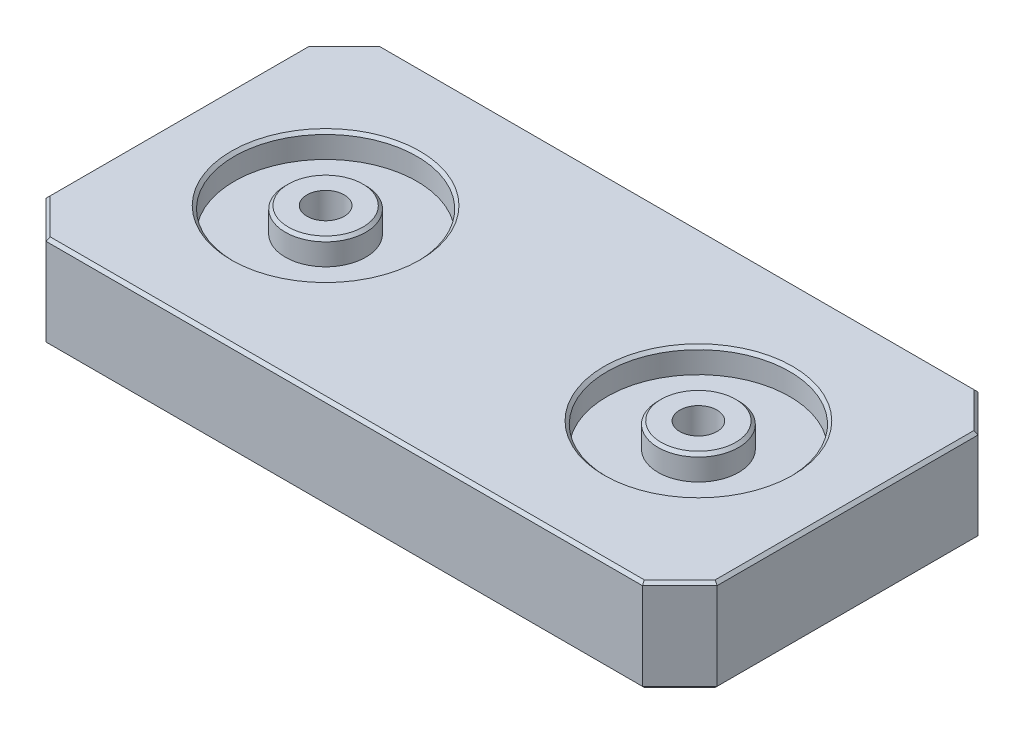
ISO-10303-21;
HEADER;
FILE_DESCRIPTION(('STEP AP214'),'2;1');
FILE_NAME('part.step','',(''),(''),'','','');
FILE_SCHEMA(('AUTOMOTIVE_DESIGN { 1 0 10303 214 1 1 1 1 }'));
ENDSEC;
DATA;
#1=APPLICATION_CONTEXT('core data for automotive mechanical design processes');
#2=APPLICATION_PROTOCOL_DEFINITION('international standard','automotive_design',2000,#1);
#3=PRODUCT_CONTEXT('',#1,'mechanical');
#4=PRODUCT('Part','Part','',(#3));
#5=PRODUCT_RELATED_PRODUCT_CATEGORY('part','',(#4));
#6=PRODUCT_DEFINITION_FORMATION('','',#4);
#7=PRODUCT_DEFINITION_CONTEXT('part definition',#1,'design');
#8=PRODUCT_DEFINITION('design','',#6,#7);
#9=PRODUCT_DEFINITION_SHAPE('','',#8);
#10=(LENGTH_UNIT() NAMED_UNIT(*) SI_UNIT(.MILLI.,.METRE.));
#11=(NAMED_UNIT(*) PLANE_ANGLE_UNIT() SI_UNIT($,.RADIAN.));
#12=(NAMED_UNIT(*) SI_UNIT($,.STERADIAN.) SOLID_ANGLE_UNIT());
#13=UNCERTAINTY_MEASURE_WITH_UNIT(LENGTH_MEASURE(1.E-05),#10,'distance_accuracy_value','');
#14=(GEOMETRIC_REPRESENTATION_CONTEXT(3) GLOBAL_UNCERTAINTY_ASSIGNED_CONTEXT((#13)) GLOBAL_UNIT_ASSIGNED_CONTEXT((#10,
#11,#12)) REPRESENTATION_CONTEXT('',''));
#15=CARTESIAN_POINT('',(0.,0.,0.));
#16=DIRECTION('',(0.,0.,1.));
#17=DIRECTION('',(1.,0.,0.));
#18=AXIS2_PLACEMENT_3D('',#15,#16,#17);
#19=CARTESIAN_POINT('',(31.75,11.684,0.));
#20=DIRECTION('',(0.,1.,0.));
#21=DIRECTION('',(0.,0.,1.));
#22=AXIS2_PLACEMENT_3D('',#19,#20,#21);
#23=PLANE('',#22);
#24=CARTESIAN_POINT('',(31.75,11.684,0.));
#25=DIRECTION('',(0.,1.,0.));
#26=DIRECTION('',(0.,0.,1.));
#27=AXIS2_PLACEMENT_3D('',#24,#25,#26);
#28=CIRCLE('',#27,15.5575);
#29=CARTESIAN_POINT('',(31.75,11.684,15.5575));
#30=VERTEX_POINT('',#29);
#31=EDGE_CURVE('E386',#30,#30,#28,.T.);
#32=ORIENTED_EDGE('',*,*,#31,.T.);
#33=EDGE_LOOP('',(#32));
#34=FACE_BOUND('',#33,.T.);
#35=CARTESIAN_POINT('',(31.75,11.684,0.));
#36=DIRECTION('',(0.,1.,0.));
#37=DIRECTION('',(0.,0.,1.));
#38=AXIS2_PLACEMENT_3D('',#35,#36,#37);
#39=CIRCLE('',#38,6.858);
#40=CARTESIAN_POINT('',(31.75,11.684,6.858));
#41=VERTEX_POINT('',#40);
#42=EDGE_CURVE('E296',#41,#41,#39,.T.);
#43=ORIENTED_EDGE('',*,*,#42,.F.);
#44=EDGE_LOOP('',(#43));
#45=FACE_BOUND('',#44,.T.);
#46=ADVANCED_FACE('F67',(#34,#45),#23,.T.);
#47=CARTESIAN_POINT('',(-31.75,11.684,0.));
#48=DIRECTION('',(0.,1.,0.));
#49=DIRECTION('',(0.,0.,1.));
#50=AXIS2_PLACEMENT_3D('',#47,#48,#49);
#51=PLANE('',#50);
#52=CARTESIAN_POINT('',(-31.75,11.684,0.));
#53=DIRECTION('',(0.,1.,0.));
#54=DIRECTION('',(0.,0.,1.));
#55=AXIS2_PLACEMENT_3D('',#52,#53,#54);
#56=CIRCLE('',#55,15.5575);
#57=CARTESIAN_POINT('',(-31.75,11.684,15.5575));
#58=VERTEX_POINT('',#57);
#59=EDGE_CURVE('E381',#58,#58,#56,.T.);
#60=ORIENTED_EDGE('',*,*,#59,.T.);
#61=EDGE_LOOP('',(#60));
#62=FACE_BOUND('',#61,.T.);
#63=CARTESIAN_POINT('',(-31.75,11.684,0.));
#64=DIRECTION('',(0.,1.,0.));
#65=DIRECTION('',(0.,0.,1.));
#66=AXIS2_PLACEMENT_3D('',#63,#64,#65);
#67=CIRCLE('',#66,6.858);
#68=CARTESIAN_POINT('',(-31.75,11.684,6.858));
#69=VERTEX_POINT('',#68);
#70=EDGE_CURVE('E389',#69,#69,#67,.T.);
#71=ORIENTED_EDGE('',*,*,#70,.F.);
#72=EDGE_LOOP('',(#71));
#73=FACE_BOUND('',#72,.T.);
#74=ADVANCED_FACE('F455',(#62,#73),#51,.T.);
#75=CARTESIAN_POINT('',(-57.15,15.875,-28.575));
#76=DIRECTION('',(1.,0.,0.));
#77=DIRECTION('',(0.,0.,-1.));
#78=AXIS2_PLACEMENT_3D('',#75,#76,#77);
#79=PLANE('',#78);
#80=DIRECTION('',(0.,1.,0.));
#81=VECTOR('',#80,1.);
#82=CARTESIAN_POINT('',(-57.15,0.,-22.225));
#83=LINE('',#82,#81);
#84=CARTESIAN_POINT('',(-57.15,0.507999999999995,-22.225));
#85=VERTEX_POINT('',#84);
#86=CARTESIAN_POINT('',(-57.15,15.367,-22.225));
#87=VERTEX_POINT('',#86);
#88=EDGE_CURVE('E335',#85,#87,#83,.T.);
#89=ORIENTED_EDGE('',*,*,#88,.F.);
#90=DIRECTION('',(0.,0.,1.));
#91=VECTOR('',#90,1.);
#92=CARTESIAN_POINT('',(-57.15,0.507999999999995,-28.575));
#93=LINE('',#92,#91);
#94=CARTESIAN_POINT('',(-57.15,0.507999999999995,22.225));
#95=VERTEX_POINT('',#94);
#96=EDGE_CURVE('E218',#85,#95,#93,.T.);
#97=ORIENTED_EDGE('',*,*,#96,.T.);
#98=DIRECTION('',(0.,1.,0.));
#99=VECTOR('',#98,1.);
#100=CARTESIAN_POINT('',(-57.15,0.,22.225));
#101=LINE('',#100,#99);
#102=CARTESIAN_POINT('',(-57.15,15.367,22.225));
#103=VERTEX_POINT('',#102);
#104=EDGE_CURVE('E337',#95,#103,#101,.T.);
#105=ORIENTED_EDGE('',*,*,#104,.T.);
#106=DIRECTION('',(0.,0.,-1.));
#107=VECTOR('',#106,1.);
#108=CARTESIAN_POINT('',(-57.15,15.367,-22.225));
#109=LINE('',#108,#107);
#110=EDGE_CURVE('E216',#103,#87,#109,.T.);
#111=ORIENTED_EDGE('',*,*,#110,.T.);
#112=EDGE_LOOP('',(#89,#97,#105,#111));
#113=FACE_BOUND('',#112,.T.);
#114=ADVANCED_FACE('F334',(#113),#79,.F.);
#115=CARTESIAN_POINT('',(-57.15,15.875,28.575));
#116=DIRECTION('',(0.,0.,-1.));
#117=DIRECTION('',(-1.,0.,0.));
#118=AXIS2_PLACEMENT_3D('',#115,#116,#117);
#119=PLANE('',#118);
#120=DIRECTION('',(0.,1.,0.));
#121=VECTOR('',#120,1.);
#122=CARTESIAN_POINT('',(-50.8,0.,28.575));
#123=LINE('',#122,#121);
#124=CARTESIAN_POINT('',(-50.8,0.507999999999995,28.575));
#125=VERTEX_POINT('',#124);
#126=CARTESIAN_POINT('',(-50.8,15.367,28.575));
#127=VERTEX_POINT('',#126);
#128=EDGE_CURVE('E344',#125,#127,#123,.T.);
#129=ORIENTED_EDGE('',*,*,#128,.F.);
#130=DIRECTION('',(1.,0.,0.));
#131=VECTOR('',#130,1.);
#132=CARTESIAN_POINT('',(-57.15,0.507999999999995,28.575));
#133=LINE('',#132,#131);
#134=CARTESIAN_POINT('',(50.8,0.507999999999995,28.575));
#135=VERTEX_POINT('',#134);
#136=EDGE_CURVE('E226',#125,#135,#133,.T.);
#137=ORIENTED_EDGE('',*,*,#136,.T.);
#138=DIRECTION('',(0.,1.,0.));
#139=VECTOR('',#138,1.);
#140=CARTESIAN_POINT('',(50.8,0.,28.575));
#141=LINE('',#140,#139);
#142=CARTESIAN_POINT('',(50.8,15.367,28.575));
#143=VERTEX_POINT('',#142);
#144=EDGE_CURVE('E370',#135,#143,#141,.T.);
#145=ORIENTED_EDGE('',*,*,#144,.T.);
#146=DIRECTION('',(-1.,0.,0.));
#147=VECTOR('',#146,1.);
#148=CARTESIAN_POINT('',(-50.8,15.367,28.575));
#149=LINE('',#148,#147);
#150=EDGE_CURVE('E224',#143,#127,#149,.T.);
#151=ORIENTED_EDGE('',*,*,#150,.T.);
#152=EDGE_LOOP('',(#129,#137,#145,#151));
#153=FACE_BOUND('',#152,.T.);
#154=ADVANCED_FACE('F499',(#153),#119,.F.);
#155=CARTESIAN_POINT('',(57.15,15.875,-28.575));
#156=DIRECTION('',(-1.,0.,0.));
#157=DIRECTION('',(0.,0.,1.));
#158=AXIS2_PLACEMENT_3D('',#155,#156,#157);
#159=PLANE('',#158);
#160=DIRECTION('',(0.,1.,0.));
#161=VECTOR('',#160,1.);
#162=CARTESIAN_POINT('',(57.15,0.,22.225));
#163=LINE('',#162,#161);
#164=CARTESIAN_POINT('',(57.15,0.507999999999995,22.225));
#165=VERTEX_POINT('',#164);
#166=CARTESIAN_POINT('',(57.15,15.367,22.225));
#167=VERTEX_POINT('',#166);
#168=EDGE_CURVE('E372',#165,#167,#163,.T.);
#169=ORIENTED_EDGE('',*,*,#168,.F.);
#170=DIRECTION('',(0.,0.,-1.));
#171=VECTOR('',#170,1.);
#172=CARTESIAN_POINT('',(57.15,0.507999999999995,-28.575));
#173=LINE('',#172,#171);
#174=CARTESIAN_POINT('',(57.15,0.507999999999995,-22.225));
#175=VERTEX_POINT('',#174);
#176=EDGE_CURVE('E235',#165,#175,#173,.T.);
#177=ORIENTED_EDGE('',*,*,#176,.T.);
#178=DIRECTION('',(0.,1.,0.));
#179=VECTOR('',#178,1.);
#180=CARTESIAN_POINT('',(57.15,0.,-22.225));
#181=LINE('',#180,#179);
#182=CARTESIAN_POINT('',(57.15,15.367,-22.225));
#183=VERTEX_POINT('',#182);
#184=EDGE_CURVE('E376',#175,#183,#181,.T.);
#185=ORIENTED_EDGE('',*,*,#184,.T.);
#186=DIRECTION('',(0.,0.,1.));
#187=VECTOR('',#186,1.);
#188=CARTESIAN_POINT('',(57.15,15.367,22.225));
#189=LINE('',#188,#187);
#190=EDGE_CURVE('E232',#183,#167,#189,.T.);
#191=ORIENTED_EDGE('',*,*,#190,.T.);
#192=EDGE_LOOP('',(#169,#177,#185,#191));
#193=FACE_BOUND('',#192,.T.);
#194=ADVANCED_FACE('F495',(#193),#159,.F.);
#195=CARTESIAN_POINT('',(-57.15,15.875,-28.575));
#196=DIRECTION('',(0.,0.,1.));
#197=DIRECTION('',(1.,0.,0.));
#198=AXIS2_PLACEMENT_3D('',#195,#196,#197);
#199=PLANE('',#198);
#200=DIRECTION('',(0.,1.,0.));
#201=VECTOR('',#200,1.);
#202=CARTESIAN_POINT('',(50.8,0.,-28.575));
#203=LINE('',#202,#201);
#204=CARTESIAN_POINT('',(50.8,0.507999999999995,-28.575));
#205=VERTEX_POINT('',#204);
#206=CARTESIAN_POINT('',(50.8,15.367,-28.575));
#207=VERTEX_POINT('',#206);
#208=EDGE_CURVE('E378',#205,#207,#203,.T.);
#209=ORIENTED_EDGE('',*,*,#208,.F.);
#210=DIRECTION('',(-1.,0.,0.));
#211=VECTOR('',#210,1.);
#212=CARTESIAN_POINT('',(-57.15,0.507999999999995,-28.575));
#213=LINE('',#212,#211);
#214=CARTESIAN_POINT('',(-50.8,0.507999999999995,-28.575));
#215=VERTEX_POINT('',#214);
#216=EDGE_CURVE('E243',#205,#215,#213,.T.);
#217=ORIENTED_EDGE('',*,*,#216,.T.);
#218=DIRECTION('',(0.,1.,0.));
#219=VECTOR('',#218,1.);
#220=CARTESIAN_POINT('',(-50.8,0.,-28.575));
#221=LINE('',#220,#219);
#222=CARTESIAN_POINT('',(-50.8,15.367,-28.575));
#223=VERTEX_POINT('',#222);
#224=EDGE_CURVE('E202',#215,#223,#221,.T.);
#225=ORIENTED_EDGE('',*,*,#224,.T.);
#226=DIRECTION('',(1.,0.,0.));
#227=VECTOR('',#226,1.);
#228=CARTESIAN_POINT('',(50.8,15.367,-28.575));
#229=LINE('',#228,#227);
#230=EDGE_CURVE('E241',#223,#207,#229,.T.);
#231=ORIENTED_EDGE('',*,*,#230,.T.);
#232=EDGE_LOOP('',(#209,#217,#225,#231));
#233=FACE_BOUND('',#232,.T.);
#234=ADVANCED_FACE('F489',(#233),#199,.F.);
#235=CARTESIAN_POINT('',(-57.15,15.875,28.575));
#236=DIRECTION('',(0.,1.,0.));
#237=DIRECTION('',(0.,0.,1.));
#238=AXIS2_PLACEMENT_3D('',#235,#236,#237);
#239=PLANE('',#238);
#240=DIRECTION('',(0.707106781186548,0.,-0.707106781186548));
#241=VECTOR('',#240,1.);
#242=CARTESIAN_POINT('',(56.7907897551572,15.875,21.8657897551572));
#243=LINE('',#242,#241);
#244=CARTESIAN_POINT('',(50.5895795103145,15.875,28.067));
#245=VERTEX_POINT('',#244);
#246=CARTESIAN_POINT('',(56.642,15.875,22.0145795103145));
#247=VERTEX_POINT('',#246);
#248=EDGE_CURVE('E84',#245,#247,#243,.T.);
#249=ORIENTED_EDGE('',*,*,#248,.T.);
#250=DIRECTION('',(0.,0.,-1.));
#251=VECTOR('',#250,1.);
#252=CARTESIAN_POINT('',(56.642,15.875,-22.225));
#253=LINE('',#252,#251);
#254=CARTESIAN_POINT('',(56.642,15.875,-22.0145795103145));
#255=VERTEX_POINT('',#254);
#256=EDGE_CURVE('E263',#247,#255,#253,.T.);
#257=ORIENTED_EDGE('',*,*,#256,.T.);
#258=DIRECTION('',(-0.707106781186548,0.,-0.707106781186547));
#259=VECTOR('',#258,1.);
#260=CARTESIAN_POINT('',(50.4407897551573,15.875,-28.2157897551573));
#261=LINE('',#260,#259);
#262=CARTESIAN_POINT('',(50.5895795103145,15.875,-28.067));
#263=VERTEX_POINT('',#262);
#264=EDGE_CURVE('E251',#255,#263,#261,.T.);
#265=ORIENTED_EDGE('',*,*,#264,.T.);
#266=DIRECTION('',(-1.,0.,0.));
#267=VECTOR('',#266,1.);
#268=CARTESIAN_POINT('',(-50.8,15.875,-28.067));
#269=LINE('',#268,#267);
#270=CARTESIAN_POINT('',(-50.5895795103145,15.875,-28.067));
#271=VERTEX_POINT('',#270);
#272=EDGE_CURVE('E253',#263,#271,#269,.T.);
#273=ORIENTED_EDGE('',*,*,#272,.T.);
#274=DIRECTION('',(-0.707106781186548,0.,0.707106781186547));
#275=VECTOR('',#274,1.);
#276=CARTESIAN_POINT('',(-56.7907897551572,15.875,-21.8657897551572));
#277=LINE('',#276,#275);
#278=CARTESIAN_POINT('',(-56.642,15.875,-22.0145795103145));
#279=VERTEX_POINT('',#278);
#280=EDGE_CURVE('E255',#271,#279,#277,.T.);
#281=ORIENTED_EDGE('',*,*,#280,.T.);
#282=DIRECTION('',(0.,0.,1.));
#283=VECTOR('',#282,1.);
#284=CARTESIAN_POINT('',(-56.642,15.875,22.225));
#285=LINE('',#284,#283);
#286=CARTESIAN_POINT('',(-56.642,15.875,22.0145795103145));
#287=VERTEX_POINT('',#286);
#288=EDGE_CURVE('E257',#279,#287,#285,.T.);
#289=ORIENTED_EDGE('',*,*,#288,.T.);
#290=DIRECTION('',(0.707106781186548,0.,0.707106781186547));
#291=VECTOR('',#290,1.);
#292=CARTESIAN_POINT('',(-50.4407897551572,15.875,28.2157897551572));
#293=LINE('',#292,#291);
#294=CARTESIAN_POINT('',(-50.5895795103145,15.875,28.067));
#295=VERTEX_POINT('',#294);
#296=EDGE_CURVE('E259',#287,#295,#293,.T.);
#297=ORIENTED_EDGE('',*,*,#296,.T.);
#298=DIRECTION('',(1.,0.,0.));
#299=VECTOR('',#298,1.);
#300=CARTESIAN_POINT('',(50.8,15.875,28.067));
#301=LINE('',#300,#299);
#302=EDGE_CURVE('E89',#295,#245,#301,.T.);
#303=ORIENTED_EDGE('',*,*,#302,.T.);
#304=EDGE_LOOP('',(#249,#257,#265,#273,#281,#289,#297,#303));
#305=FACE_BOUND('',#304,.T.);
#306=CARTESIAN_POINT('',(-31.75,15.875,0.));
#307=DIRECTION('',(0.,1.,0.));
#308=DIRECTION('',(0.,0.,1.));
#309=AXIS2_PLACEMENT_3D('',#306,#307,#308);
#310=CIRCLE('',#309,16.0655);
#311=CARTESIAN_POINT('',(-31.75,15.875,16.0655));
#312=VERTEX_POINT('',#311);
#313=EDGE_CURVE('E248',#312,#312,#310,.F.);
#314=ORIENTED_EDGE('',*,*,#313,.T.);
#315=EDGE_LOOP('',(#314));
#316=FACE_BOUND('',#315,.T.);
#317=CARTESIAN_POINT('',(31.75,15.875,0.));
#318=DIRECTION('',(0.,1.,0.));
#319=DIRECTION('',(0.,0.,1.));
#320=AXIS2_PLACEMENT_3D('',#317,#318,#319);
#321=CIRCLE('',#320,16.0655);
#322=CARTESIAN_POINT('',(31.75,15.875,16.0655));
#323=VERTEX_POINT('',#322);
#324=EDGE_CURVE('E245',#323,#323,#321,.F.);
#325=ORIENTED_EDGE('',*,*,#324,.T.);
#326=EDGE_LOOP('',(#325));
#327=FACE_BOUND('',#326,.T.);
#328=ADVANCED_FACE('F486',(#305,#316,#327),#239,.T.);
#329=CARTESIAN_POINT('',(-57.15,0.,28.575));
#330=DIRECTION('',(0.,1.,0.));
#331=DIRECTION('',(0.,0.,1.));
#332=AXIS2_PLACEMENT_3D('',#329,#330,#331);
#333=PLANE('',#332);
#334=CARTESIAN_POINT('',(-31.75,0.,0.));
#335=DIRECTION('',(0.,1.,0.));
#336=DIRECTION('',(0.,0.,1.));
#337=AXIS2_PLACEMENT_3D('',#334,#335,#336);
#338=CIRCLE('',#337,3.175);
#339=CARTESIAN_POINT('',(-31.75,0.,3.175));
#340=VERTEX_POINT('',#339);
#341=EDGE_CURVE('E423',#340,#340,#338,.T.);
#342=ORIENTED_EDGE('',*,*,#341,.T.);
#343=EDGE_LOOP('',(#342));
#344=FACE_BOUND('',#343,.T.);
#345=CARTESIAN_POINT('',(31.75,0.,0.));
#346=DIRECTION('',(0.,1.,0.));
#347=DIRECTION('',(0.,0.,1.));
#348=AXIS2_PLACEMENT_3D('',#345,#346,#347);
#349=CIRCLE('',#348,3.175);
#350=CARTESIAN_POINT('',(31.75,0.,3.175));
#351=VERTEX_POINT('',#350);
#352=EDGE_CURVE('E415',#351,#351,#349,.T.);
#353=ORIENTED_EDGE('',*,*,#352,.T.);
#354=EDGE_LOOP('',(#353));
#355=FACE_BOUND('',#354,.T.);
#356=CARTESIAN_POINT('',(31.75,0.,-15.875));
#357=DIRECTION('',(0.,-1.,0.));
#358=DIRECTION('',(0.,0.,-1.));
#359=AXIS2_PLACEMENT_3D('',#356,#357,#358);
#360=CIRCLE('',#359,7.112);
#361=CARTESIAN_POINT('',(31.75,0.,-22.987));
#362=VERTEX_POINT('',#361);
#363=EDGE_CURVE('E412',#362,#362,#360,.T.);
#364=ORIENTED_EDGE('',*,*,#363,.F.);
#365=EDGE_LOOP('',(#364));
#366=FACE_BOUND('',#365,.T.);
#367=CARTESIAN_POINT('',(31.75,0.,15.875));
#368=DIRECTION('',(0.,-1.,0.));
#369=DIRECTION('',(0.,0.,-1.));
#370=AXIS2_PLACEMENT_3D('',#367,#368,#369);
#371=CIRCLE('',#370,7.112);
#372=CARTESIAN_POINT('',(31.75,0.,8.76300000000001));
#373=VERTEX_POINT('',#372);
#374=EDGE_CURVE('E406',#373,#373,#371,.T.);
#375=ORIENTED_EDGE('',*,*,#374,.F.);
#376=EDGE_LOOP('',(#375));
#377=FACE_BOUND('',#376,.T.);
#378=CARTESIAN_POINT('',(-31.75,0.,-15.875));
#379=DIRECTION('',(0.,-1.,0.));
#380=DIRECTION('',(0.,0.,-1.));
#381=AXIS2_PLACEMENT_3D('',#378,#379,#380);
#382=CIRCLE('',#381,7.112);
#383=CARTESIAN_POINT('',(-31.75,0.,-22.987));
#384=VERTEX_POINT('',#383);
#385=EDGE_CURVE('E400',#384,#384,#382,.T.);
#386=ORIENTED_EDGE('',*,*,#385,.F.);
#387=EDGE_LOOP('',(#386));
#388=FACE_BOUND('',#387,.T.);
#389=CARTESIAN_POINT('',(-31.75,0.,15.875));
#390=DIRECTION('',(0.,-1.,0.));
#391=DIRECTION('',(0.,0.,-1.));
#392=AXIS2_PLACEMENT_3D('',#389,#390,#391);
#393=CIRCLE('',#392,7.112);
#394=CARTESIAN_POINT('',(-31.75,0.,8.76300000000001));
#395=VERTEX_POINT('',#394);
#396=EDGE_CURVE('E394',#395,#395,#393,.T.);
#397=ORIENTED_EDGE('',*,*,#396,.F.);
#398=EDGE_LOOP('',(#397));
#399=FACE_BOUND('',#398,.T.);
#400=DIRECTION('',(0.,0.,-1.));
#401=VECTOR('',#400,1.);
#402=CARTESIAN_POINT('',(-56.642,0.,28.575));
#403=LINE('',#402,#401);
#404=CARTESIAN_POINT('',(-56.642,0.,22.0145795103145));
#405=VERTEX_POINT('',#404);
#406=CARTESIAN_POINT('',(-56.642,0.,-22.0145795103145));
#407=VERTEX_POINT('',#406);
#408=EDGE_CURVE('E206',#405,#407,#403,.T.);
#409=ORIENTED_EDGE('',*,*,#408,.T.);
#410=DIRECTION('',(0.707106781186548,0.,-0.707106781186547));
#411=VECTOR('',#410,1.);
#412=CARTESIAN_POINT('',(-82.1907897551572,0.,3.53421024484275));
#413=LINE('',#412,#411);
#414=CARTESIAN_POINT('',(-50.5895795103145,0.,-28.067));
#415=VERTEX_POINT('',#414);
#416=EDGE_CURVE('E187',#407,#415,#413,.T.);
#417=ORIENTED_EDGE('',*,*,#416,.T.);
#418=DIRECTION('',(1.,0.,0.));
#419=VECTOR('',#418,1.);
#420=CARTESIAN_POINT('',(-57.15,0.,-28.067));
#421=LINE('',#420,#419);
#422=CARTESIAN_POINT('',(50.5895795103145,0.,-28.067));
#423=VERTEX_POINT('',#422);
#424=EDGE_CURVE('E195',#415,#423,#421,.T.);
#425=ORIENTED_EDGE('',*,*,#424,.T.);
#426=DIRECTION('',(0.707106781186548,0.,0.707106781186547));
#427=VECTOR('',#426,1.);
#428=CARTESIAN_POINT('',(25.0407897551572,0.,-53.6157897551573));
#429=LINE('',#428,#427);
#430=CARTESIAN_POINT('',(56.642,0.,-22.0145795103145));
#431=VERTEX_POINT('',#430);
#432=EDGE_CURVE('E201',#423,#431,#429,.T.);
#433=ORIENTED_EDGE('',*,*,#432,.T.);
#434=DIRECTION('',(0.,0.,1.));
#435=VECTOR('',#434,1.);
#436=CARTESIAN_POINT('',(56.642,0.,28.575));
#437=LINE('',#436,#435);
#438=CARTESIAN_POINT('',(56.642,0.,22.0145795103145));
#439=VERTEX_POINT('',#438);
#440=EDGE_CURVE('E349',#431,#439,#437,.T.);
#441=ORIENTED_EDGE('',*,*,#440,.T.);
#442=DIRECTION('',(-0.707106781186548,0.,0.707106781186548));
#443=VECTOR('',#442,1.);
#444=CARTESIAN_POINT('',(-3.53421024484277,0.,82.1907897551572));
#445=LINE('',#444,#443);
#446=CARTESIAN_POINT('',(50.5895795103145,0.,28.067));
#447=VERTEX_POINT('',#446);
#448=EDGE_CURVE('E351',#439,#447,#445,.T.);
#449=ORIENTED_EDGE('',*,*,#448,.T.);
#450=DIRECTION('',(-1.,0.,0.));
#451=VECTOR('',#450,1.);
#452=CARTESIAN_POINT('',(-57.15,0.,28.067));
#453=LINE('',#452,#451);
#454=CARTESIAN_POINT('',(-50.5895795103145,0.,28.067));
#455=VERTEX_POINT('',#454);
#456=EDGE_CURVE('E353',#447,#455,#453,.T.);
#457=ORIENTED_EDGE('',*,*,#456,.T.);
#458=DIRECTION('',(-0.707106781186548,0.,-0.707106781186547));
#459=VECTOR('',#458,1.);
#460=CARTESIAN_POINT('',(-53.6157897551572,0.,25.0407897551572));
#461=LINE('',#460,#459);
#462=EDGE_CURVE('E211',#455,#405,#461,.T.);
#463=ORIENTED_EDGE('',*,*,#462,.T.);
#464=EDGE_LOOP('',(#409,#417,#425,#433,#441,#449,#457,#463));
#465=FACE_BOUND('',#464,.T.);
#466=ADVANCED_FACE('F204',(#344,#355,#366,#377,#388,#399,#465),#333,.F.);
#467=CARTESIAN_POINT('',(-57.15,0.,-22.225));
#468=DIRECTION('',(0.707106781186547,0.,0.707106781186548));
#469=DIRECTION('',(0.707106781186548,0.,-0.707106781186547));
#470=AXIS2_PLACEMENT_3D('',#467,#468,#469);
#471=PLANE('',#470);
#472=ORIENTED_EDGE('',*,*,#224,.F.);
#473=DIRECTION('',(-0.707106781186548,0.,0.707106781186547));
#474=VECTOR('',#473,1.);
#475=CARTESIAN_POINT('',(-57.15,0.507999999999994,-22.225));
#476=LINE('',#475,#474);
#477=EDGE_CURVE('E189',#215,#85,#476,.T.);
#478=ORIENTED_EDGE('',*,*,#477,.T.);
#479=ORIENTED_EDGE('',*,*,#88,.T.);
#480=DIRECTION('',(0.707106781186548,0.,-0.707106781186547));
#481=VECTOR('',#480,1.);
#482=CARTESIAN_POINT('',(-50.8,15.367,-28.575));
#483=LINE('',#482,#481);
#484=EDGE_CURVE('E208',#87,#223,#483,.T.);
#485=ORIENTED_EDGE('',*,*,#484,.T.);
#486=EDGE_LOOP('',(#472,#478,#479,#485));
#487=FACE_BOUND('',#486,.T.);
#488=ADVANCED_FACE('F340',(#487),#471,.F.);
#489=CARTESIAN_POINT('',(-57.15,0.,22.225));
#490=DIRECTION('',(0.707106781186547,0.,-0.707106781186548));
#491=DIRECTION('',(-0.707106781186548,0.,-0.707106781186547));
#492=AXIS2_PLACEMENT_3D('',#489,#490,#491);
#493=PLANE('',#492);
#494=ORIENTED_EDGE('',*,*,#104,.F.);
#495=DIRECTION('',(0.707106781186548,0.,0.707106781186547));
#496=VECTOR('',#495,1.);
#497=CARTESIAN_POINT('',(-57.15,0.507999999999994,22.225));
#498=LINE('',#497,#496);
#499=EDGE_CURVE('E222',#95,#125,#498,.T.);
#500=ORIENTED_EDGE('',*,*,#499,.T.);
#501=ORIENTED_EDGE('',*,*,#128,.T.);
#502=DIRECTION('',(-0.707106781186548,0.,-0.707106781186547));
#503=VECTOR('',#502,1.);
#504=CARTESIAN_POINT('',(-57.15,15.367,22.225));
#505=LINE('',#504,#503);
#506=EDGE_CURVE('E220',#127,#103,#505,.T.);
#507=ORIENTED_EDGE('',*,*,#506,.T.);
#508=EDGE_LOOP('',(#494,#500,#501,#507));
#509=FACE_BOUND('',#508,.T.);
#510=ADVANCED_FACE('F365',(#509),#493,.F.);
#511=CARTESIAN_POINT('',(57.15,0.,22.225));
#512=DIRECTION('',(-0.707106781186548,0.,-0.707106781186548));
#513=DIRECTION('',(-0.707106781186548,0.,0.707106781186548));
#514=AXIS2_PLACEMENT_3D('',#511,#512,#513);
#515=PLANE('',#514);
#516=ORIENTED_EDGE('',*,*,#144,.F.);
#517=DIRECTION('',(0.707106781186548,0.,-0.707106781186548));
#518=VECTOR('',#517,1.);
#519=CARTESIAN_POINT('',(57.15,0.507999999999996,22.225));
#520=LINE('',#519,#518);
#521=EDGE_CURVE('E230',#135,#165,#520,.T.);
#522=ORIENTED_EDGE('',*,*,#521,.T.);
#523=ORIENTED_EDGE('',*,*,#168,.T.);
#524=DIRECTION('',(-0.707106781186548,0.,0.707106781186548));
#525=VECTOR('',#524,1.);
#526=CARTESIAN_POINT('',(50.8,15.367,28.575));
#527=LINE('',#526,#525);
#528=EDGE_CURVE('E228',#167,#143,#527,.T.);
#529=ORIENTED_EDGE('',*,*,#528,.T.);
#530=EDGE_LOOP('',(#516,#522,#523,#529));
#531=FACE_BOUND('',#530,.T.);
#532=ADVANCED_FACE('F477',(#531),#515,.F.);
#533=CARTESIAN_POINT('',(57.15,0.,-22.225));
#534=DIRECTION('',(-0.707106781186547,0.,0.707106781186548));
#535=DIRECTION('',(0.707106781186548,0.,0.707106781186547));
#536=AXIS2_PLACEMENT_3D('',#533,#534,#535);
#537=PLANE('',#536);
#538=ORIENTED_EDGE('',*,*,#184,.F.);
#539=DIRECTION('',(-0.707106781186548,0.,-0.707106781186547));
#540=VECTOR('',#539,1.);
#541=CARTESIAN_POINT('',(57.15,0.507999999999993,-22.225));
#542=LINE('',#541,#540);
#543=EDGE_CURVE('E239',#175,#205,#542,.T.);
#544=ORIENTED_EDGE('',*,*,#543,.T.);
#545=ORIENTED_EDGE('',*,*,#208,.T.);
#546=DIRECTION('',(0.707106781186548,0.,0.707106781186547));
#547=VECTOR('',#546,1.);
#548=CARTESIAN_POINT('',(57.15,15.367,-22.225));
#549=LINE('',#548,#547);
#550=EDGE_CURVE('E237',#207,#183,#549,.T.);
#551=ORIENTED_EDGE('',*,*,#550,.T.);
#552=EDGE_LOOP('',(#538,#544,#545,#551));
#553=FACE_BOUND('',#552,.T.);
#554=ADVANCED_FACE('F473',(#553),#537,.F.);
#555=CARTESIAN_POINT('',(-31.75,11.684,0.));
#556=DIRECTION('',(0.,1.,0.));
#557=DIRECTION('',(0.,0.,1.));
#558=AXIS2_PLACEMENT_3D('',#555,#556,#557);
#559=CYLINDRICAL_SURFACE('',#558,15.5575);
#560=CARTESIAN_POINT('',(-31.75,15.367,0.));
#561=DIRECTION('',(0.,1.,0.));
#562=DIRECTION('',(0.,0.,1.));
#563=AXIS2_PLACEMENT_3D('',#560,#561,#562);
#564=CIRCLE('',#563,15.5575);
#565=CARTESIAN_POINT('',(-31.75,15.367,15.5575));
#566=VERTEX_POINT('',#565);
#567=EDGE_CURVE('E265',#566,#566,#564,.T.);
#568=ORIENTED_EDGE('',*,*,#567,.T.);
#569=EDGE_LOOP('',(#568));
#570=FACE_BOUND('',#569,.T.);
#571=ORIENTED_EDGE('',*,*,#59,.F.);
#572=EDGE_LOOP('',(#571));
#573=FACE_BOUND('',#572,.T.);
#574=ADVANCED_FACE('F468',(#570,#573),#559,.F.);
#575=CARTESIAN_POINT('',(31.75,11.684,0.));
#576=DIRECTION('',(0.,1.,0.));
#577=DIRECTION('',(0.,0.,1.));
#578=AXIS2_PLACEMENT_3D('',#575,#576,#577);
#579=CYLINDRICAL_SURFACE('',#578,15.5575);
#580=CARTESIAN_POINT('',(31.75,15.367,0.));
#581=DIRECTION('',(0.,1.,0.));
#582=DIRECTION('',(0.,0.,1.));
#583=AXIS2_PLACEMENT_3D('',#580,#581,#582);
#584=CIRCLE('',#583,15.5575);
#585=CARTESIAN_POINT('',(31.75,15.367,15.5575));
#586=VERTEX_POINT('',#585);
#587=EDGE_CURVE('E268',#586,#586,#584,.T.);
#588=ORIENTED_EDGE('',*,*,#587,.T.);
#589=EDGE_LOOP('',(#588));
#590=FACE_BOUND('',#589,.T.);
#591=ORIENTED_EDGE('',*,*,#31,.F.);
#592=EDGE_LOOP('',(#591));
#593=FACE_BOUND('',#592,.T.);
#594=ADVANCED_FACE('F466',(#590,#593),#579,.F.);
#595=CARTESIAN_POINT('',(-31.75,35.2723532215094,0.));
#596=DIRECTION('',(0.,-1.,0.));
#597=DIRECTION('',(0.,0.,-1.));
#598=AXIS2_PLACEMENT_3D('',#595,#596,#597);
#599=CYLINDRICAL_SURFACE('',#598,6.858);
#600=CARTESIAN_POINT('',(-31.75,15.367,0.));
#601=DIRECTION('',(0.,1.,0.));
#602=DIRECTION('',(0.,0.,1.));
#603=AXIS2_PLACEMENT_3D('',#600,#601,#602);
#604=CIRCLE('',#603,6.858);
#605=CARTESIAN_POINT('',(-31.75,15.367,6.858));
#606=VERTEX_POINT('',#605);
#607=EDGE_CURVE('E14',#606,#606,#604,.F.);
#608=ORIENTED_EDGE('',*,*,#607,.T.);
#609=EDGE_LOOP('',(#608));
#610=FACE_BOUND('',#609,.T.);
#611=ORIENTED_EDGE('',*,*,#70,.T.);
#612=EDGE_LOOP('',(#611));
#613=FACE_BOUND('',#612,.T.);
#614=ADVANCED_FACE('F436',(#610,#613),#599,.T.);
#615=CARTESIAN_POINT('',(-57.15,15.875,28.575));
#616=DIRECTION('',(0.,1.,0.));
#617=DIRECTION('',(0.,0.,1.));
#618=AXIS2_PLACEMENT_3D('',#615,#616,#617);
#619=PLANE('',#618);
#620=CARTESIAN_POINT('',(-31.75,15.875,0.));
#621=DIRECTION('',(0.,1.,0.));
#622=DIRECTION('',(0.,0.,1.));
#623=AXIS2_PLACEMENT_3D('',#620,#621,#622);
#624=CIRCLE('',#623,3.17499999999999);
#625=CARTESIAN_POINT('',(-31.75,15.875,3.17499999999999));
#626=VERTEX_POINT('',#625);
#627=EDGE_CURVE('E426',#626,#626,#624,.T.);
#628=ORIENTED_EDGE('',*,*,#627,.F.);
#629=EDGE_LOOP('',(#628));
#630=FACE_BOUND('',#629,.T.);
#631=CARTESIAN_POINT('',(-31.75,15.875,0.));
#632=DIRECTION('',(0.,1.,0.));
#633=DIRECTION('',(0.,0.,1.));
#634=AXIS2_PLACEMENT_3D('',#631,#632,#633);
#635=CIRCLE('',#634,6.35000000000005);
#636=CARTESIAN_POINT('',(-31.75,15.875,6.35000000000005));
#637=VERTEX_POINT('',#636);
#638=EDGE_CURVE('E76',#637,#637,#635,.T.);
#639=ORIENTED_EDGE('',*,*,#638,.T.);
#640=EDGE_LOOP('',(#639));
#641=FACE_BOUND('',#640,.T.);
#642=ADVANCED_FACE('F432',(#630,#641),#619,.T.);
#643=CARTESIAN_POINT('',(31.75,35.2723532215094,0.));
#644=DIRECTION('',(0.,-1.,0.));
#645=DIRECTION('',(0.,0.,-1.));
#646=AXIS2_PLACEMENT_3D('',#643,#644,#645);
#647=CYLINDRICAL_SURFACE('',#646,6.858);
#648=CARTESIAN_POINT('',(31.75,15.367,0.));
#649=DIRECTION('',(0.,1.,0.));
#650=DIRECTION('',(0.,0.,1.));
#651=AXIS2_PLACEMENT_3D('',#648,#649,#650);
#652=CIRCLE('',#651,6.858);
#653=CARTESIAN_POINT('',(31.75,15.367,6.858));
#654=VERTEX_POINT('',#653);
#655=EDGE_CURVE('E274',#654,#654,#652,.F.);
#656=ORIENTED_EDGE('',*,*,#655,.T.);
#657=EDGE_LOOP('',(#656));
#658=FACE_BOUND('',#657,.T.);
#659=ORIENTED_EDGE('',*,*,#42,.T.);
#660=EDGE_LOOP('',(#659));
#661=FACE_BOUND('',#660,.T.);
#662=ADVANCED_FACE('F435',(#658,#661),#647,.T.);
#663=CARTESIAN_POINT('',(-57.15,15.875,28.575));
#664=DIRECTION('',(0.,1.,0.));
#665=DIRECTION('',(0.,0.,1.));
#666=AXIS2_PLACEMENT_3D('',#663,#664,#665);
#667=PLANE('',#666);
#668=CARTESIAN_POINT('',(31.75,15.875,0.));
#669=DIRECTION('',(0.,1.,0.));
#670=DIRECTION('',(0.,0.,1.));
#671=AXIS2_PLACEMENT_3D('',#668,#669,#670);
#672=CIRCLE('',#671,3.17499999999998);
#673=CARTESIAN_POINT('',(31.75,15.875,3.17499999999998));
#674=VERTEX_POINT('',#673);
#675=EDGE_CURVE('E420',#674,#674,#672,.T.);
#676=ORIENTED_EDGE('',*,*,#675,.F.);
#677=EDGE_LOOP('',(#676));
#678=FACE_BOUND('',#677,.T.);
#679=CARTESIAN_POINT('',(31.75,15.875,0.));
#680=DIRECTION('',(0.,1.,0.));
#681=DIRECTION('',(0.,0.,1.));
#682=AXIS2_PLACEMENT_3D('',#679,#680,#681);
#683=CIRCLE('',#682,6.35000000000002);
#684=CARTESIAN_POINT('',(31.75,15.875,6.35000000000002));
#685=VERTEX_POINT('',#684);
#686=EDGE_CURVE('E271',#685,#685,#683,.T.);
#687=ORIENTED_EDGE('',*,*,#686,.T.);
#688=EDGE_LOOP('',(#687));
#689=FACE_BOUND('',#688,.T.);
#690=ADVANCED_FACE('F528',(#678,#689),#667,.T.);
#691=CARTESIAN_POINT('',(-3.53421024484277,0.,82.1907897551572));
#692=DIRECTION('',(-0.499999999999997,0.707106781186552,-0.499999999999997));
#693=DIRECTION('',(0.,0.577350269189621,0.81649658092773));
#694=AXIS2_PLACEMENT_3D('',#691,#692,#693);
#695=PLANE('',#694);
#696=DIRECTION('',(-0.678598344545858,-0.67859834454584,-0.281084637714812));
#697=VECTOR('',#696,1.);
#698=CARTESIAN_POINT('',(47.4602266526084,-9.18177334739135,18.2113644631892));
#699=LINE('',#698,#697);
#700=EDGE_CURVE('E290',#165,#439,#699,.T.);
#701=ORIENTED_EDGE('',*,*,#700,.F.);
#702=ORIENTED_EDGE('',*,*,#521,.F.);
#703=DIRECTION('',(-0.281084637714812,-0.67859834454584,-0.678598344545858));
#704=VECTOR('',#703,1.);
#705=CARTESIAN_POINT('',(56.6371009567943,14.6000082948341,42.6670082948345));
#706=LINE('',#705,#704);
#707=EDGE_CURVE('E293',#447,#135,#706,.F.);
#708=ORIENTED_EDGE('',*,*,#707,.F.);
#709=ORIENTED_EDGE('',*,*,#448,.F.);
#710=EDGE_LOOP('',(#701,#702,#708,#709));
#711=FACE_BOUND('',#710,.T.);
#712=ADVANCED_FACE('F524',(#711),#695,.F.);
#713=CARTESIAN_POINT('',(-57.15,0.507999999999995,28.575));
#714=DIRECTION('',(0.,0.707106781186557,-0.707106781186538));
#715=DIRECTION('',(0.,0.707106781186538,0.707106781186557));
#716=AXIS2_PLACEMENT_3D('',#713,#714,#715);
#717=PLANE('',#716);
#718=ORIENTED_EDGE('',*,*,#707,.T.);
#719=ORIENTED_EDGE('',*,*,#136,.F.);
#720=DIRECTION('',(0.281084637714821,-0.678598344545838,-0.678598344545856));
#721=VECTOR('',#720,1.);
#722=CARTESIAN_POINT('',(-51.3017044421014,1.71922166842395,29.786221668424));
#723=LINE('',#722,#721);
#724=EDGE_CURVE('E287',#455,#125,#723,.F.);
#725=ORIENTED_EDGE('',*,*,#724,.F.);
#726=ORIENTED_EDGE('',*,*,#456,.F.);
#727=EDGE_LOOP('',(#718,#719,#725,#726));
#728=FACE_BOUND('',#727,.T.);
#729=ADVANCED_FACE('F520',(#728),#717,.F.);
#730=CARTESIAN_POINT('',(57.15,0.507999999999995,-28.575));
#731=DIRECTION('',(-0.707106781186538,0.707106781186557,0.));
#732=DIRECTION('',(-0.707106781186557,-0.707106781186538,0.));
#733=AXIS2_PLACEMENT_3D('',#730,#731,#732);
#734=PLANE('',#733);
#735=ORIENTED_EDGE('',*,*,#700,.T.);
#736=ORIENTED_EDGE('',*,*,#440,.F.);
#737=DIRECTION('',(-0.678598344545859,-0.678598344545841,0.281084637714806));
#738=VECTOR('',#737,1.);
#739=CARTESIAN_POINT('',(48.1175058027406,-8.52449419725912,-18.4836184014392));
#740=LINE('',#739,#738);
#741=EDGE_CURVE('E284',#175,#431,#740,.T.);
#742=ORIENTED_EDGE('',*,*,#741,.F.);
#743=ORIENTED_EDGE('',*,*,#176,.F.);
#744=EDGE_LOOP('',(#735,#736,#742,#743));
#745=FACE_BOUND('',#744,.T.);
#746=ADVANCED_FACE('F517',(#745),#734,.F.);
#747=CARTESIAN_POINT('',(-53.6157897551572,0.,25.0407897551572));
#748=DIRECTION('',(0.499999999999993,0.707106781186556,-0.499999999999994));
#749=DIRECTION('',(0.,0.577350269189617,0.816496580927732));
#750=AXIS2_PLACEMENT_3D('',#747,#748,#749);
#751=PLANE('',#750);
#752=ORIENTED_EDGE('',*,*,#724,.T.);
#753=ORIENTED_EDGE('',*,*,#499,.F.);
#754=DIRECTION('',(0.678598344545856,-0.678598344545837,-0.281084637714822));
#755=VECTOR('',#754,1.);
#756=CARTESIAN_POINT('',(-55.8256733001054,-0.816326699894565,21.6764459198909));
#757=LINE('',#756,#755);
#758=EDGE_CURVE('E281',#405,#95,#757,.F.);
#759=ORIENTED_EDGE('',*,*,#758,.F.);
#760=ORIENTED_EDGE('',*,*,#462,.F.);
#761=EDGE_LOOP('',(#752,#753,#759,#760));
#762=FACE_BOUND('',#761,.T.);
#763=ADVANCED_FACE('F360',(#762),#751,.F.);
#764=CARTESIAN_POINT('',(25.0407897551572,0.,-53.6157897551573));
#765=DIRECTION('',(-0.499999999999998,0.70710678118655,0.499999999999999));
#766=DIRECTION('',(0.,-0.577350269189623,0.816496580927728));
#767=AXIS2_PLACEMENT_3D('',#764,#765,#766);
#768=PLANE('',#767);
#769=ORIENTED_EDGE('',*,*,#741,.T.);
#770=ORIENTED_EDGE('',*,*,#432,.F.);
#771=DIRECTION('',(-0.281084637714805,-0.678598344545841,0.678598344545859));
#772=VECTOR('',#771,1.);
#773=CARTESIAN_POINT('',(42.2710244842775,-20.0827683632062,-7.98423163679325));
#774=LINE('',#773,#772);
#775=EDGE_CURVE('E198',#205,#423,#774,.T.);
#776=ORIENTED_EDGE('',*,*,#775,.F.);
#777=ORIENTED_EDGE('',*,*,#543,.F.);
#778=EDGE_LOOP('',(#769,#770,#776,#777));
#779=FACE_BOUND('',#778,.T.);
#780=ADVANCED_FACE('F511',(#779),#768,.F.);
#781=CARTESIAN_POINT('',(-57.15,0.507999999999995,-28.575));
#782=DIRECTION('',(0.707106781186538,0.707106781186557,0.));
#783=DIRECTION('',(-0.707106781186557,0.707106781186538,0.));
#784=AXIS2_PLACEMENT_3D('',#781,#782,#783);
#785=PLANE('',#784);
#786=ORIENTED_EDGE('',*,*,#758,.T.);
#787=ORIENTED_EDGE('',*,*,#96,.F.);
#788=DIRECTION('',(0.678598344545857,-0.678598344545838,0.281084637714818));
#789=VECTOR('',#788,1.);
#790=CARTESIAN_POINT('',(-58.361221668424,1.71922166842394,-22.7267044421014));
#791=LINE('',#790,#789);
#792=EDGE_CURVE('E192',#407,#85,#791,.F.);
#793=ORIENTED_EDGE('',*,*,#792,.F.);
#794=ORIENTED_EDGE('',*,*,#408,.F.);
#795=EDGE_LOOP('',(#786,#787,#793,#794));
#796=FACE_BOUND('',#795,.T.);
#797=ADVANCED_FACE('F363',(#796),#785,.F.);
#798=CARTESIAN_POINT('',(-57.15,0.507999999999995,-28.575));
#799=DIRECTION('',(0.,0.707106781186557,0.707106781186538));
#800=DIRECTION('',(0.,-0.707106781186538,0.707106781186557));
#801=AXIS2_PLACEMENT_3D('',#798,#799,#800);
#802=PLANE('',#801);
#803=ORIENTED_EDGE('',*,*,#775,.T.);
#804=ORIENTED_EDGE('',*,*,#424,.F.);
#805=DIRECTION('',(-0.281084637714818,0.678598344545838,-0.678598344545857));
#806=VECTOR('',#805,1.);
#807=CARTESIAN_POINT('',(-51.3017044421014,1.71922166842394,-29.786221668424));
#808=LINE('',#807,#806);
#809=EDGE_CURVE('E183',#215,#415,#808,.F.);
#810=ORIENTED_EDGE('',*,*,#809,.F.);
#811=ORIENTED_EDGE('',*,*,#216,.F.);
#812=EDGE_LOOP('',(#803,#804,#810,#811));
#813=FACE_BOUND('',#812,.T.);
#814=ADVANCED_FACE('F196',(#813),#802,.F.);
#815=CARTESIAN_POINT('',(-82.1907897551572,0.,3.53421024484275));
#816=DIRECTION('',(0.499999999999995,0.707106781186555,0.499999999999995));
#817=DIRECTION('',(0.,-0.577350269189618,0.816496580927732));
#818=AXIS2_PLACEMENT_3D('',#815,#816,#817);
#819=PLANE('',#818);
#820=ORIENTED_EDGE('',*,*,#792,.T.);
#821=ORIENTED_EDGE('',*,*,#477,.F.);
#822=ORIENTED_EDGE('',*,*,#809,.T.);
#823=ORIENTED_EDGE('',*,*,#416,.F.);
#824=EDGE_LOOP('',(#820,#821,#822,#823));
#825=FACE_BOUND('',#824,.T.);
#826=ADVANCED_FACE('F185',(#825),#819,.F.);
#827=CARTESIAN_POINT('',(-56.642,15.875,28.575));
#828=DIRECTION('',(-0.707106781186543,0.707106781186552,0.));
#829=DIRECTION('',(-0.707106781186552,-0.707106781186543,0.));
#830=AXIS2_PLACEMENT_3D('',#827,#828,#829);
#831=PLANE('',#830);
#832=DIRECTION('',(0.678598344545853,0.678598344545843,0.281084637714816));
#833=VECTOR('',#832,1.);
#834=CARTESIAN_POINT('',(-57.15,15.367,-22.225));
#835=LINE('',#834,#833);
#836=EDGE_CURVE('E313',#87,#279,#835,.T.);
#837=ORIENTED_EDGE('',*,*,#836,.F.);
#838=ORIENTED_EDGE('',*,*,#110,.F.);
#839=DIRECTION('',(0.678598344545851,0.678598344545842,-0.281084637714822));
#840=VECTOR('',#839,1.);
#841=CARTESIAN_POINT('',(-57.8933580237921,14.6236419762079,22.5329089751536));
#842=LINE('',#841,#840);
#843=EDGE_CURVE('E71',#287,#103,#842,.F.);
#844=ORIENTED_EDGE('',*,*,#843,.F.);
#845=ORIENTED_EDGE('',*,*,#288,.F.);
#846=EDGE_LOOP('',(#837,#838,#844,#845));
#847=FACE_BOUND('',#846,.T.);
#848=ADVANCED_FACE('F329',(#847),#831,.T.);
#849=CARTESIAN_POINT('',(-57.15,15.367,22.225));
#850=DIRECTION('',(-0.499999999999996,0.707106781186552,0.499999999999997));
#851=DIRECTION('',(0.,-0.577350269189621,0.816496580927729));
#852=AXIS2_PLACEMENT_3D('',#849,#850,#851);
#853=PLANE('',#852);
#854=ORIENTED_EDGE('',*,*,#843,.T.);
#855=ORIENTED_EDGE('',*,*,#506,.F.);
#856=DIRECTION('',(0.281084637714826,0.678598344545844,-0.678598344545848));
#857=VECTOR('',#856,1.);
#858=CARTESIAN_POINT('',(-50.0904827736774,17.0799261105253,26.8620738894747));
#859=LINE('',#858,#857);
#860=EDGE_CURVE('E311',#295,#127,#859,.F.);
#861=ORIENTED_EDGE('',*,*,#860,.F.);
#862=ORIENTED_EDGE('',*,*,#296,.F.);
#863=EDGE_LOOP('',(#854,#855,#861,#862));
#864=FACE_BOUND('',#863,.T.);
#865=ADVANCED_FACE('F324',(#864),#853,.T.);
#866=CARTESIAN_POINT('',(-57.15,15.367,-22.225));
#867=DIRECTION('',(-0.499999999999998,0.70710678118655,-0.499999999999998));
#868=DIRECTION('',(0.,0.577350269189623,0.816496580927728));
#869=AXIS2_PLACEMENT_3D('',#866,#867,#868);
#870=PLANE('',#869);
#871=ORIENTED_EDGE('',*,*,#836,.T.);
#872=ORIENTED_EDGE('',*,*,#280,.F.);
#873=DIRECTION('',(0.281084637714816,0.678598344545843,0.678598344545853));
#874=VECTOR('',#873,1.);
#875=CARTESIAN_POINT('',(-51.1079089751535,14.6236419762079,-29.3183580237921));
#876=LINE('',#875,#874);
#877=EDGE_CURVE('E308',#223,#271,#876,.T.);
#878=ORIENTED_EDGE('',*,*,#877,.F.);
#879=ORIENTED_EDGE('',*,*,#484,.F.);
#880=EDGE_LOOP('',(#871,#872,#878,#879));
#881=FACE_BOUND('',#880,.T.);
#882=ADVANCED_FACE('F550',(#881),#870,.T.);
#883=CARTESIAN_POINT('',(-57.15,15.875,28.067));
#884=DIRECTION('',(0.,0.70710678118655,0.707106781186545));
#885=DIRECTION('',(0.,-0.707106781186545,0.70710678118655));
#886=AXIS2_PLACEMENT_3D('',#883,#884,#885);
#887=PLANE('',#886);
#888=ORIENTED_EDGE('',*,*,#860,.T.);
#889=ORIENTED_EDGE('',*,*,#150,.F.);
#890=DIRECTION('',(-0.281084637714827,0.678598344545843,-0.678598344545848));
#891=VECTOR('',#890,1.);
#892=CARTESIAN_POINT('',(42.0772290173284,36.4256320078397,7.51636799216014));
#893=LINE('',#892,#891);
#894=EDGE_CURVE('E305',#245,#143,#893,.F.);
#895=ORIENTED_EDGE('',*,*,#894,.F.);
#896=ORIENTED_EDGE('',*,*,#302,.F.);
#897=EDGE_LOOP('',(#888,#889,#895,#896));
#898=FACE_BOUND('',#897,.T.);
#899=ADVANCED_FACE('F546',(#898),#887,.T.);
#900=CARTESIAN_POINT('',(-57.15,15.875,-28.067));
#901=DIRECTION('',(0.,0.707106781186552,-0.707106781186543));
#902=DIRECTION('',(0.,0.707106781186543,0.707106781186552));
#903=AXIS2_PLACEMENT_3D('',#900,#901,#902);
#904=PLANE('',#903);
#905=ORIENTED_EDGE('',*,*,#877,.T.);
#906=ORIENTED_EDGE('',*,*,#272,.F.);
#907=DIRECTION('',(-0.281084637714786,0.67859834454585,0.678598344545859));
#908=VECTOR('',#907,1.);
#909=CARTESIAN_POINT('',(50.0904827736774,17.0799261105256,-26.8620738894744));
#910=LINE('',#909,#908);
#911=EDGE_CURVE('E302',#207,#263,#910,.T.);
#912=ORIENTED_EDGE('',*,*,#911,.F.);
#913=ORIENTED_EDGE('',*,*,#230,.F.);
#914=EDGE_LOOP('',(#905,#906,#912,#913));
#915=FACE_BOUND('',#914,.T.);
#916=ADVANCED_FACE('F542',(#915),#904,.T.);
#917=CARTESIAN_POINT('',(57.15,15.367,22.225));
#918=DIRECTION('',(0.499999999999997,0.707106781186552,0.499999999999997));
#919=DIRECTION('',(0.,-0.577350269189621,0.81649658092773));
#920=AXIS2_PLACEMENT_3D('',#917,#918,#919);
#921=PLANE('',#920);
#922=ORIENTED_EDGE('',*,*,#894,.T.);
#923=ORIENTED_EDGE('',*,*,#528,.F.);
#924=DIRECTION('',(-0.678598344545858,0.67859834454584,-0.281084637714812));
#925=VECTOR('',#924,1.);
#926=CARTESIAN_POINT('',(57.15,15.367,22.225));
#927=LINE('',#926,#925);
#928=EDGE_CURVE('E299',#247,#167,#927,.F.);
#929=ORIENTED_EDGE('',*,*,#928,.F.);
#930=ORIENTED_EDGE('',*,*,#248,.F.);
#931=EDGE_LOOP('',(#922,#923,#929,#930));
#932=FACE_BOUND('',#931,.T.);
#933=ADVANCED_FACE('F538',(#932),#921,.T.);
#934=CARTESIAN_POINT('',(57.15,15.367,-22.225));
#935=DIRECTION('',(0.500000000000007,0.707106781186538,-0.500000000000007));
#936=DIRECTION('',(0.,0.577350269189637,0.816496580927718));
#937=AXIS2_PLACEMENT_3D('',#934,#935,#936);
#938=PLANE('',#937);
#939=ORIENTED_EDGE('',*,*,#911,.T.);
#940=ORIENTED_EDGE('',*,*,#264,.F.);
#941=DIRECTION('',(0.678598344545866,-0.678598344545847,-0.281084637714775));
#942=VECTOR('',#941,1.);
#943=CARTESIAN_POINT('',(57.15,15.367,-22.225));
#944=LINE('',#943,#942);
#945=EDGE_CURVE('E297',#183,#255,#944,.F.);
#946=ORIENTED_EDGE('',*,*,#945,.F.);
#947=ORIENTED_EDGE('',*,*,#550,.F.);
#948=EDGE_LOOP('',(#939,#940,#946,#947));
#949=FACE_BOUND('',#948,.T.);
#950=ADVANCED_FACE('F534',(#949),#938,.T.);
#951=CARTESIAN_POINT('',(56.642,15.875,28.575));
#952=DIRECTION('',(0.707106781186538,0.707106781186557,0.));
#953=DIRECTION('',(-0.707106781186557,0.707106781186538,0.));
#954=AXIS2_PLACEMENT_3D('',#951,#952,#953);
#955=PLANE('',#954);
#956=ORIENTED_EDGE('',*,*,#928,.T.);
#957=ORIENTED_EDGE('',*,*,#190,.F.);
#958=ORIENTED_EDGE('',*,*,#945,.T.);
#959=ORIENTED_EDGE('',*,*,#256,.F.);
#960=EDGE_LOOP('',(#956,#957,#958,#959));
#961=FACE_BOUND('',#960,.T.);
#962=ADVANCED_FACE('F530',(#961),#955,.T.);
#963=CARTESIAN_POINT('',(-31.75,15.367,0.));
#964=DIRECTION('',(0.,1.,0.));
#965=DIRECTION('',(0.,0.,1.));
#966=AXIS2_PLACEMENT_3D('',#963,#964,#965);
#967=CONICAL_SURFACE('',#966,15.5575,0.785398163397442);
#968=ORIENTED_EDGE('',*,*,#313,.F.);
#969=EDGE_LOOP('',(#968));
#970=FACE_BOUND('',#969,.T.);
#971=ORIENTED_EDGE('',*,*,#567,.F.);
#972=EDGE_LOOP('',(#971));
#973=FACE_BOUND('',#972,.T.);
#974=ADVANCED_FACE('F533',(#970,#973),#967,.F.);
#975=CARTESIAN_POINT('',(31.75,15.367,0.));
#976=DIRECTION('',(0.,1.,0.));
#977=DIRECTION('',(0.,0.,1.));
#978=AXIS2_PLACEMENT_3D('',#975,#976,#977);
#979=CONICAL_SURFACE('',#978,15.5575,0.785398163397442);
#980=ORIENTED_EDGE('',*,*,#324,.F.);
#981=EDGE_LOOP('',(#980));
#982=FACE_BOUND('',#981,.T.);
#983=ORIENTED_EDGE('',*,*,#587,.F.);
#984=EDGE_LOOP('',(#983));
#985=FACE_BOUND('',#984,.T.);
#986=ADVANCED_FACE('F451',(#982,#985),#979,.F.);
#987=CARTESIAN_POINT('',(31.75,15.875,0.));
#988=DIRECTION('',(0.,-1.,0.));
#989=DIRECTION('',(0.,0.,-1.));
#990=AXIS2_PLACEMENT_3D('',#987,#988,#989);
#991=CONICAL_SURFACE('',#990,6.35000000000002,0.78539816339745);
#992=ORIENTED_EDGE('',*,*,#655,.F.);
#993=EDGE_LOOP('',(#992));
#994=FACE_BOUND('',#993,.T.);
#995=ORIENTED_EDGE('',*,*,#686,.F.);
#996=EDGE_LOOP('',(#995));
#997=FACE_BOUND('',#996,.T.);
#998=ADVANCED_FACE('F442',(#994,#997),#991,.T.);
#999=CARTESIAN_POINT('',(-31.75,15.875,0.));
#1000=DIRECTION('',(0.,-1.,0.));
#1001=DIRECTION('',(0.,0.,-1.));
#1002=AXIS2_PLACEMENT_3D('',#999,#1000,#1001);
#1003=CONICAL_SURFACE('',#1002,6.35000000000005,0.78539816339744);
#1004=ORIENTED_EDGE('',*,*,#607,.F.);
#1005=EDGE_LOOP('',(#1004));
#1006=FACE_BOUND('',#1005,.T.);
#1007=ORIENTED_EDGE('',*,*,#638,.F.);
#1008=EDGE_LOOP('',(#1007));
#1009=FACE_BOUND('',#1008,.T.);
#1010=ADVANCED_FACE('F69',(#1006,#1009),#1003,.T.);
#1011=CARTESIAN_POINT('',(-31.75,1.905,15.875));
#1012=DIRECTION('',(0.,-1.,0.));
#1013=DIRECTION('',(0.,0.,-1.));
#1014=AXIS2_PLACEMENT_3D('',#1011,#1012,#1013);
#1015=CYLINDRICAL_SURFACE('',#1014,7.112);
#1016=CARTESIAN_POINT('',(-31.75,1.905,15.875));
#1017=DIRECTION('',(0.,-1.,0.));
#1018=DIRECTION('',(0.,0.,-1.));
#1019=AXIS2_PLACEMENT_3D('',#1016,#1017,#1018);
#1020=CIRCLE('',#1019,7.112);
#1021=CARTESIAN_POINT('',(-31.75,1.905,8.76300000000001));
#1022=VERTEX_POINT('',#1021);
#1023=EDGE_CURVE('E300',#1022,#1022,#1020,.T.);
#1024=ORIENTED_EDGE('',*,*,#1023,.F.);
#1025=EDGE_LOOP('',(#1024));
#1026=FACE_BOUND('',#1025,.T.);
#1027=ORIENTED_EDGE('',*,*,#396,.T.);
#1028=EDGE_LOOP('',(#1027));
#1029=FACE_BOUND('',#1028,.T.);
#1030=ADVANCED_FACE('F441',(#1026,#1029),#1015,.F.);
#1031=CARTESIAN_POINT('',(-31.75,1.905,15.875));
#1032=DIRECTION('',(0.,-1.,0.));
#1033=DIRECTION('',(0.,0.,-1.));
#1034=AXIS2_PLACEMENT_3D('',#1031,#1032,#1033);
#1035=PLANE('',#1034);
#1036=ORIENTED_EDGE('',*,*,#1023,.T.);
#1037=EDGE_LOOP('',(#1036));
#1038=FACE_BOUND('',#1037,.T.);
#1039=ADVANCED_FACE('F448',(#1038),#1035,.T.);
#1040=CARTESIAN_POINT('',(-31.75,1.905,-15.875));
#1041=DIRECTION('',(0.,-1.,0.));
#1042=DIRECTION('',(0.,0.,-1.));
#1043=AXIS2_PLACEMENT_3D('',#1040,#1041,#1042);
#1044=CYLINDRICAL_SURFACE('',#1043,7.112);
#1045=CARTESIAN_POINT('',(-31.75,1.905,-15.875));
#1046=DIRECTION('',(0.,-1.,0.));
#1047=DIRECTION('',(0.,0.,-1.));
#1048=AXIS2_PLACEMENT_3D('',#1045,#1046,#1047);
#1049=CIRCLE('',#1048,7.112);
#1050=CARTESIAN_POINT('',(-31.75,1.905,-22.987));
#1051=VERTEX_POINT('',#1050);
#1052=EDGE_CURVE('E397',#1051,#1051,#1049,.T.);
#1053=ORIENTED_EDGE('',*,*,#1052,.F.);
#1054=EDGE_LOOP('',(#1053));
#1055=FACE_BOUND('',#1054,.T.);
#1056=ORIENTED_EDGE('',*,*,#385,.T.);
#1057=EDGE_LOOP('',(#1056));
#1058=FACE_BOUND('',#1057,.T.);
#1059=ADVANCED_FACE('F596',(#1055,#1058),#1044,.F.);
#1060=CARTESIAN_POINT('',(-31.75,1.905,-15.875));
#1061=DIRECTION('',(0.,-1.,0.));
#1062=DIRECTION('',(0.,0.,-1.));
#1063=AXIS2_PLACEMENT_3D('',#1060,#1061,#1062);
#1064=PLANE('',#1063);
#1065=ORIENTED_EDGE('',*,*,#1052,.T.);
#1066=EDGE_LOOP('',(#1065));
#1067=FACE_BOUND('',#1066,.T.);
#1068=ADVANCED_FACE('F606',(#1067),#1064,.T.);
#1069=CARTESIAN_POINT('',(31.75,1.905,15.875));
#1070=DIRECTION('',(0.,-1.,0.));
#1071=DIRECTION('',(0.,0.,-1.));
#1072=AXIS2_PLACEMENT_3D('',#1069,#1070,#1071);
#1073=CYLINDRICAL_SURFACE('',#1072,7.112);
#1074=CARTESIAN_POINT('',(31.75,1.905,15.875));
#1075=DIRECTION('',(0.,-1.,0.));
#1076=DIRECTION('',(0.,0.,-1.));
#1077=AXIS2_PLACEMENT_3D('',#1074,#1075,#1076);
#1078=CIRCLE('',#1077,7.112);
#1079=CARTESIAN_POINT('',(31.75,1.905,8.76300000000001));
#1080=VERTEX_POINT('',#1079);
#1081=EDGE_CURVE('E403',#1080,#1080,#1078,.T.);
#1082=ORIENTED_EDGE('',*,*,#1081,.F.);
#1083=EDGE_LOOP('',(#1082));
#1084=FACE_BOUND('',#1083,.T.);
#1085=ORIENTED_EDGE('',*,*,#374,.T.);
#1086=EDGE_LOOP('',(#1085));
#1087=FACE_BOUND('',#1086,.T.);
#1088=ADVANCED_FACE('F616',(#1084,#1087),#1073,.F.);
#1089=CARTESIAN_POINT('',(31.75,1.905,15.875));
#1090=DIRECTION('',(0.,-1.,0.));
#1091=DIRECTION('',(0.,0.,-1.));
#1092=AXIS2_PLACEMENT_3D('',#1089,#1090,#1091);
#1093=PLANE('',#1092);
#1094=ORIENTED_EDGE('',*,*,#1081,.T.);
#1095=EDGE_LOOP('',(#1094));
#1096=FACE_BOUND('',#1095,.T.);
#1097=ADVANCED_FACE('F626',(#1096),#1093,.T.);
#1098=CARTESIAN_POINT('',(31.75,1.905,-15.875));
#1099=DIRECTION('',(0.,-1.,0.));
#1100=DIRECTION('',(0.,0.,-1.));
#1101=AXIS2_PLACEMENT_3D('',#1098,#1099,#1100);
#1102=CYLINDRICAL_SURFACE('',#1101,7.112);
#1103=CARTESIAN_POINT('',(31.75,1.905,-15.875));
#1104=DIRECTION('',(0.,-1.,0.));
#1105=DIRECTION('',(0.,0.,-1.));
#1106=AXIS2_PLACEMENT_3D('',#1103,#1104,#1105);
#1107=CIRCLE('',#1106,7.112);
#1108=CARTESIAN_POINT('',(31.75,1.905,-22.987));
#1109=VERTEX_POINT('',#1108);
#1110=EDGE_CURVE('E409',#1109,#1109,#1107,.T.);
#1111=ORIENTED_EDGE('',*,*,#1110,.F.);
#1112=EDGE_LOOP('',(#1111));
#1113=FACE_BOUND('',#1112,.T.);
#1114=ORIENTED_EDGE('',*,*,#363,.T.);
#1115=EDGE_LOOP('',(#1114));
#1116=FACE_BOUND('',#1115,.T.);
#1117=ADVANCED_FACE('F636',(#1113,#1116),#1102,.F.);
#1118=CARTESIAN_POINT('',(31.75,1.905,-15.875));
#1119=DIRECTION('',(0.,-1.,0.));
#1120=DIRECTION('',(0.,0.,-1.));
#1121=AXIS2_PLACEMENT_3D('',#1118,#1119,#1120);
#1122=PLANE('',#1121);
#1123=ORIENTED_EDGE('',*,*,#1110,.T.);
#1124=EDGE_LOOP('',(#1123));
#1125=FACE_BOUND('',#1124,.T.);
#1126=ADVANCED_FACE('F646',(#1125),#1122,.T.);
#1127=CARTESIAN_POINT('',(31.75,15.875,0.));
#1128=DIRECTION('',(0.,1.,0.));
#1129=DIRECTION('',(0.,0.,1.));
#1130=AXIS2_PLACEMENT_3D('',#1127,#1128,#1129);
#1131=CYLINDRICAL_SURFACE('',#1130,3.17499999999999);
#1132=ORIENTED_EDGE('',*,*,#352,.F.);
#1133=EDGE_LOOP('',(#1132));
#1134=FACE_BOUND('',#1133,.T.);
#1135=ORIENTED_EDGE('',*,*,#675,.T.);
#1136=EDGE_LOOP('',(#1135));
#1137=FACE_BOUND('',#1136,.T.);
#1138=ADVANCED_FACE('F656',(#1134,#1137),#1131,.F.);
#1139=CARTESIAN_POINT('',(-31.75,15.875,0.));
#1140=DIRECTION('',(0.,1.,0.));
#1141=DIRECTION('',(0.,0.,1.));
#1142=AXIS2_PLACEMENT_3D('',#1139,#1140,#1141);
#1143=CYLINDRICAL_SURFACE('',#1142,3.17499999999999);
#1144=ORIENTED_EDGE('',*,*,#341,.F.);
#1145=EDGE_LOOP('',(#1144));
#1146=FACE_BOUND('',#1145,.T.);
#1147=ORIENTED_EDGE('',*,*,#627,.T.);
#1148=EDGE_LOOP('',(#1147));
#1149=FACE_BOUND('',#1148,.T.);
#1150=ADVANCED_FACE('F430',(#1146,#1149),#1143,.F.);
#1151=CLOSED_SHELL('',(#46,#74,#114,#154,#194,#234,#328,#466,#488,#510,#532,#554,#574,#594,#614,
#642,#662,#690,#712,#729,#746,#763,#780,#797,#814,#826,#848,#865,#882,#899,#916,#933,#950,#962,
#974,#986,#998,#1010,#1030,#1039,#1059,#1068,#1088,#1097,#1117,#1126,#1138,#1150));
#1152=MANIFOLD_SOLID_BREP('B2',#1151);
#1153=ADVANCED_BREP_SHAPE_REPRESENTATION('',(#18,#1152),#14);
#1154=SHAPE_DEFINITION_REPRESENTATION(#9,#1153);
ENDSEC;
END-ISO-10303-21;
